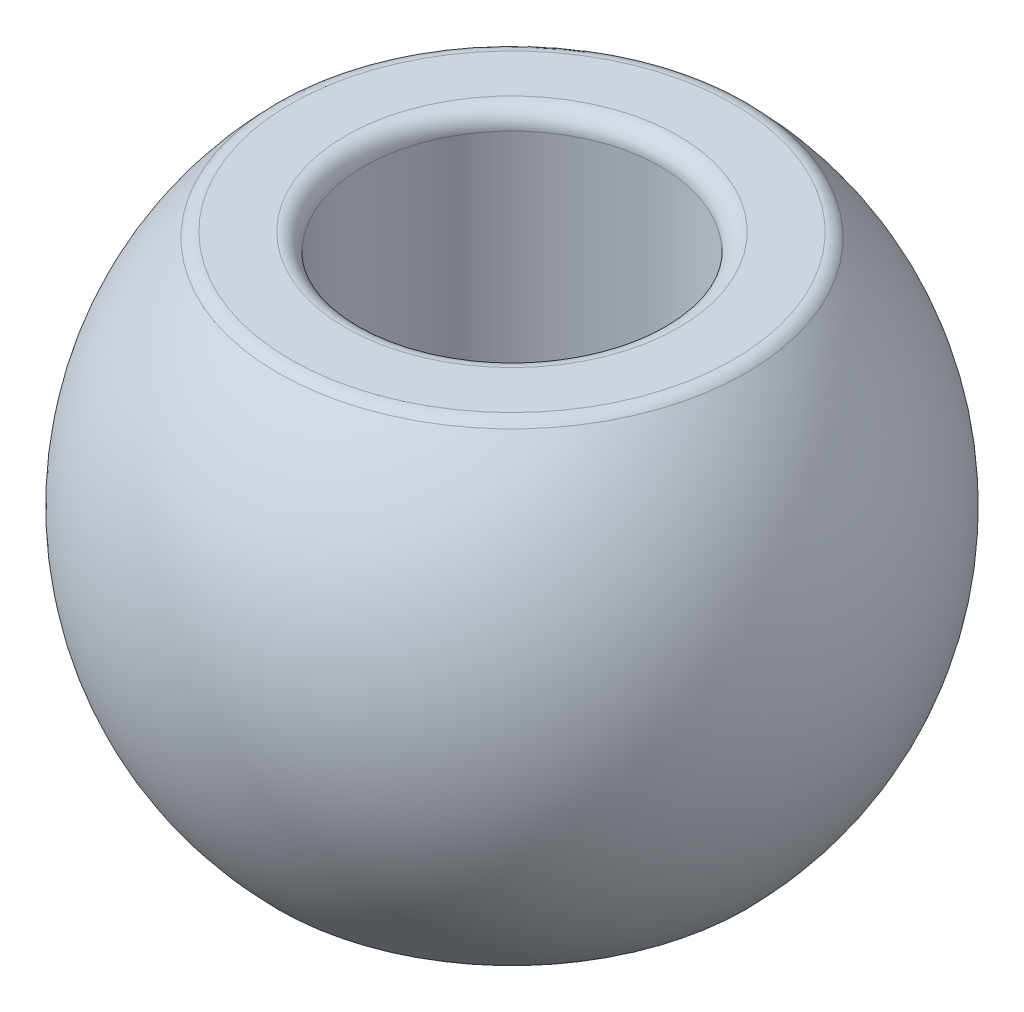
ISO-10303-21;
HEADER;
FILE_DESCRIPTION(('STEP AP214'),'2;1');
FILE_NAME('part.step','',(''),(''),'','','');
FILE_SCHEMA(('AUTOMOTIVE_DESIGN { 1 0 10303 214 1 1 1 1 }'));
ENDSEC;
DATA;
#1=APPLICATION_CONTEXT('core data for automotive mechanical design processes');
#2=APPLICATION_PROTOCOL_DEFINITION('international standard','automotive_design',2000,#1);
#3=PRODUCT_CONTEXT('',#1,'mechanical');
#4=PRODUCT('Part','Part','',(#3));
#5=PRODUCT_RELATED_PRODUCT_CATEGORY('part','',(#4));
#6=PRODUCT_DEFINITION_FORMATION('','',#4);
#7=PRODUCT_DEFINITION_CONTEXT('part definition',#1,'design');
#8=PRODUCT_DEFINITION('design','',#6,#7);
#9=PRODUCT_DEFINITION_SHAPE('','',#8);
#10=(LENGTH_UNIT() NAMED_UNIT(*) SI_UNIT(.MILLI.,.METRE.));
#11=(NAMED_UNIT(*) PLANE_ANGLE_UNIT() SI_UNIT($,.RADIAN.));
#12=(NAMED_UNIT(*) SI_UNIT($,.STERADIAN.) SOLID_ANGLE_UNIT());
#13=UNCERTAINTY_MEASURE_WITH_UNIT(LENGTH_MEASURE(1.E-05),#10,'distance_accuracy_value','');
#14=(GEOMETRIC_REPRESENTATION_CONTEXT(3) GLOBAL_UNCERTAINTY_ASSIGNED_CONTEXT((#13)) GLOBAL_UNIT_ASSIGNED_CONTEXT((#10,
#11,#12)) REPRESENTATION_CONTEXT('',''));
#15=CARTESIAN_POINT('',(0.,0.,0.));
#16=DIRECTION('',(0.,0.,1.));
#17=DIRECTION('',(1.,0.,0.));
#18=AXIS2_PLACEMENT_3D('',#15,#16,#17);
#19=CARTESIAN_POINT('',(2.5,3.99808833790323,0.));
#20=DIRECTION('',(0.,1.,0.));
#21=DIRECTION('',(0.,0.,1.));
#22=AXIS2_PLACEMENT_3D('',#19,#20,#21);
#23=PLANE('',#22);
#24=CARTESIAN_POINT('',(0.,3.99808833790323,0.));
#25=DIRECTION('',(0.,1.,0.));
#26=DIRECTION('',(0.,0.,1.));
#27=AXIS2_PLACEMENT_3D('',#24,#25,#26);
#28=CIRCLE('',#27,3.72707638753845);
#29=CARTESIAN_POINT('',(0.,3.99808833790323,3.72707638753845));
#30=VERTEX_POINT('',#29);
#31=EDGE_CURVE('E10',#30,#30,#28,.T.);
#32=ORIENTED_EDGE('',*,*,#31,.T.);
#33=EDGE_LOOP('',(#32));
#34=FACE_BOUND('',#33,.T.);
#35=CARTESIAN_POINT('',(0.,3.99808833790323,0.));
#36=DIRECTION('',(0.,1.,0.));
#37=DIRECTION('',(0.,0.,1.));
#38=AXIS2_PLACEMENT_3D('',#35,#36,#37);
#39=CIRCLE('',#38,2.8);
#40=CARTESIAN_POINT('',(0.,3.99808833790323,2.8));
#41=VERTEX_POINT('',#40);
#42=EDGE_CURVE('E45',#41,#41,#39,.F.);
#43=ORIENTED_EDGE('',*,*,#42,.T.);
#44=EDGE_LOOP('',(#43));
#45=FACE_BOUND('',#44,.T.);
#46=ADVANCED_FACE('F37',(#34,#45),#23,.T.);
#47=CARTESIAN_POINT('',(0.,0.,0.));
#48=DIRECTION('',(0.,-1.,0.));
#49=DIRECTION('',(0.,0.,-1.));
#50=AXIS2_PLACEMENT_3D('',#47,#48,#49);
#51=CYLINDRICAL_SURFACE('',#50,2.5);
#52=CARTESIAN_POINT('',(0.,-3.69808833790322,0.));
#53=DIRECTION('',(0.,-1.,0.));
#54=DIRECTION('',(0.,0.,-1.));
#55=AXIS2_PLACEMENT_3D('',#52,#53,#54);
#56=CIRCLE('',#55,2.5);
#57=CARTESIAN_POINT('',(0.,-3.69808833790322,-2.5));
#58=VERTEX_POINT('',#57);
#59=EDGE_CURVE('E69',#58,#58,#56,.T.);
#60=ORIENTED_EDGE('',*,*,#59,.T.);
#61=EDGE_LOOP('',(#60));
#62=FACE_BOUND('',#61,.T.);
#63=CARTESIAN_POINT('',(0.,3.69808833790322,0.));
#64=DIRECTION('',(0.,1.,0.));
#65=DIRECTION('',(0.,0.,1.));
#66=AXIS2_PLACEMENT_3D('',#63,#64,#65);
#67=CIRCLE('',#66,2.5);
#68=CARTESIAN_POINT('',(0.,3.69808833790322,2.5));
#69=VERTEX_POINT('',#68);
#70=EDGE_CURVE('E73',#69,#69,#67,.T.);
#71=ORIENTED_EDGE('',*,*,#70,.T.);
#72=EDGE_LOOP('',(#71));
#73=FACE_BOUND('',#72,.T.);
#74=ADVANCED_FACE('F78',(#62,#73),#51,.F.);
#75=CARTESIAN_POINT('',(2.5,-3.99808833790323,0.));
#76=DIRECTION('',(0.,-1.,0.));
#77=DIRECTION('',(0.,0.,-1.));
#78=AXIS2_PLACEMENT_3D('',#75,#76,#77);
#79=PLANE('',#78);
#80=CARTESIAN_POINT('',(0.,-3.99808833790323,0.));
#81=DIRECTION('',(0.,-1.,0.));
#82=DIRECTION('',(0.,0.,-1.));
#83=AXIS2_PLACEMENT_3D('',#80,#81,#82);
#84=CIRCLE('',#83,2.8);
#85=CARTESIAN_POINT('',(0.,-3.99808833790323,-2.8));
#86=VERTEX_POINT('',#85);
#87=EDGE_CURVE('E61',#86,#86,#84,.F.);
#88=ORIENTED_EDGE('',*,*,#87,.T.);
#89=EDGE_LOOP('',(#88));
#90=FACE_BOUND('',#89,.T.);
#91=CARTESIAN_POINT('',(0.,-3.99808833790323,0.));
#92=DIRECTION('',(0.,-1.,0.));
#93=DIRECTION('',(0.,0.,-1.));
#94=AXIS2_PLACEMENT_3D('',#91,#92,#93);
#95=CIRCLE('',#94,3.72707638753845);
#96=CARTESIAN_POINT('',(0.,-3.99808833790323,-3.72707638753845));
#97=VERTEX_POINT('',#96);
#98=EDGE_CURVE('E65',#97,#97,#95,.T.);
#99=ORIENTED_EDGE('',*,*,#98,.T.);
#100=EDGE_LOOP('',(#99));
#101=FACE_BOUND('',#100,.T.);
#102=ADVANCED_FACE('F93',(#90,#101),#79,.T.);
#103=CARTESIAN_POINT('',(0.,0.,0.));
#104=DIRECTION('',(0.,-1.,0.));
#105=DIRECTION('',(1.,0.,0.));
#106=AXIS2_PLACEMENT_3D('',#103,#104,#105);
#107=SPHERICAL_SURFACE('',#106,5.5504243403255);
#108=CARTESIAN_POINT('',(0.,-3.90939059262768,0.));
#109=DIRECTION('',(0.,1.,0.));
#110=DIRECTION('',(0.,0.,1.));
#111=AXIS2_PLACEMENT_3D('',#108,#109,#110);
#112=CIRCLE('',#111,3.94003496836664);
#113=CARTESIAN_POINT('',(0.,-3.90939059262768,3.94003496836664));
#114=VERTEX_POINT('',#113);
#115=EDGE_CURVE('E50',#114,#114,#112,.T.);
#116=ORIENTED_EDGE('',*,*,#115,.T.);
#117=EDGE_LOOP('',(#116));
#118=FACE_BOUND('',#117,.T.);
#119=CARTESIAN_POINT('',(0.,3.90939059262768,0.));
#120=DIRECTION('',(0.,-1.,0.));
#121=DIRECTION('',(0.,0.,-1.));
#122=AXIS2_PLACEMENT_3D('',#119,#120,#121);
#123=CIRCLE('',#122,3.94003496836664);
#124=CARTESIAN_POINT('',(0.,3.90939059262768,-3.94003496836664));
#125=VERTEX_POINT('',#124);
#126=EDGE_CURVE('E55',#125,#125,#123,.T.);
#127=ORIENTED_EDGE('',*,*,#126,.T.);
#128=EDGE_LOOP('',(#127));
#129=FACE_BOUND('',#128,.T.);
#130=ADVANCED_FACE('F101',(#118,#129),#107,.T.);
#131=CARTESIAN_POINT('',(0.,-3.69808833790322,0.));
#132=DIRECTION('',(0.,-1.,0.));
#133=DIRECTION('',(0.,0.,-1.));
#134=AXIS2_PLACEMENT_3D('',#131,#132,#133);
#135=TOROIDAL_SURFACE('',#134,2.8,0.3);
#136=ORIENTED_EDGE('',*,*,#87,.F.);
#137=EDGE_LOOP('',(#136));
#138=FACE_BOUND('',#137,.T.);
#139=ORIENTED_EDGE('',*,*,#59,.F.);
#140=EDGE_LOOP('',(#139));
#141=FACE_BOUND('',#140,.T.);
#142=ADVANCED_FACE('F98',(#138,#141),#135,.T.);
#143=CARTESIAN_POINT('',(0.,-3.69808833790322,0.));
#144=DIRECTION('',(0.,-1.,0.));
#145=DIRECTION('',(0.,0.,-1.));
#146=AXIS2_PLACEMENT_3D('',#143,#144,#145);
#147=TOROIDAL_SURFACE('',#146,3.72707638753845,0.3);
#148=ORIENTED_EDGE('',*,*,#115,.F.);
#149=EDGE_LOOP('',(#148));
#150=FACE_BOUND('',#149,.T.);
#151=ORIENTED_EDGE('',*,*,#98,.F.);
#152=EDGE_LOOP('',(#151));
#153=FACE_BOUND('',#152,.T.);
#154=ADVANCED_FACE('F86',(#150,#153),#147,.T.);
#155=CARTESIAN_POINT('',(0.,3.69808833790322,0.));
#156=DIRECTION('',(0.,1.,0.));
#157=DIRECTION('',(0.,0.,1.));
#158=AXIS2_PLACEMENT_3D('',#155,#156,#157);
#159=TOROIDAL_SURFACE('',#158,3.72707638753845,0.3);
#160=ORIENTED_EDGE('',*,*,#31,.F.);
#161=EDGE_LOOP('',(#160));
#162=FACE_BOUND('',#161,.T.);
#163=ORIENTED_EDGE('',*,*,#126,.F.);
#164=EDGE_LOOP('',(#163));
#165=FACE_BOUND('',#164,.T.);
#166=ADVANCED_FACE('F82',(#162,#165),#159,.T.);
#167=CARTESIAN_POINT('',(0.,3.69808833790322,0.));
#168=DIRECTION('',(0.,1.,0.));
#169=DIRECTION('',(0.,0.,1.));
#170=AXIS2_PLACEMENT_3D('',#167,#168,#169);
#171=TOROIDAL_SURFACE('',#170,2.8,0.3);
#172=ORIENTED_EDGE('',*,*,#70,.F.);
#173=EDGE_LOOP('',(#172));
#174=FACE_BOUND('',#173,.T.);
#175=ORIENTED_EDGE('',*,*,#42,.F.);
#176=EDGE_LOOP('',(#175));
#177=FACE_BOUND('',#176,.T.);
#178=ADVANCED_FACE('F39',(#174,#177),#171,.T.);
#179=CLOSED_SHELL('',(#46,#74,#102,#130,#142,#154,#166,#178));
#180=MANIFOLD_SOLID_BREP('B2',#179);
#181=ADVANCED_BREP_SHAPE_REPRESENTATION('',(#18,#180),#14);
#182=SHAPE_DEFINITION_REPRESENTATION(#9,#181);
ENDSEC;
END-ISO-10303-21;
